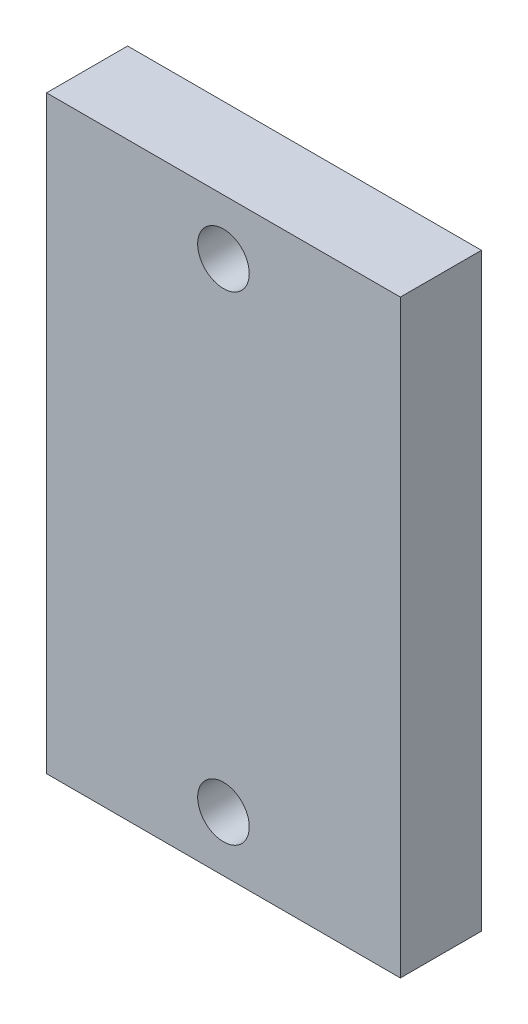
ISO-10303-21;
HEADER;
FILE_DESCRIPTION(('STEP AP214'),'2;1');
FILE_NAME('part.step','',(''),(''),'','','');
FILE_SCHEMA(('AUTOMOTIVE_DESIGN { 1 0 10303 214 1 1 1 1 }'));
ENDSEC;
DATA;
#1=APPLICATION_CONTEXT('core data for automotive mechanical design processes');
#2=APPLICATION_PROTOCOL_DEFINITION('international standard','automotive_design',2000,#1);
#3=PRODUCT_CONTEXT('',#1,'mechanical');
#4=PRODUCT('Part','Part','',(#3));
#5=PRODUCT_RELATED_PRODUCT_CATEGORY('part','',(#4));
#6=PRODUCT_DEFINITION_FORMATION('','',#4);
#7=PRODUCT_DEFINITION_CONTEXT('part definition',#1,'design');
#8=PRODUCT_DEFINITION('design','',#6,#7);
#9=PRODUCT_DEFINITION_SHAPE('','',#8);
#10=(LENGTH_UNIT() NAMED_UNIT(*) SI_UNIT(.MILLI.,.METRE.));
#11=(NAMED_UNIT(*) PLANE_ANGLE_UNIT() SI_UNIT($,.RADIAN.));
#12=(NAMED_UNIT(*) SI_UNIT($,.STERADIAN.) SOLID_ANGLE_UNIT());
#13=UNCERTAINTY_MEASURE_WITH_UNIT(LENGTH_MEASURE(1.E-05),#10,'distance_accuracy_value','');
#14=(GEOMETRIC_REPRESENTATION_CONTEXT(3) GLOBAL_UNCERTAINTY_ASSIGNED_CONTEXT((#13)) GLOBAL_UNIT_ASSIGNED_CONTEXT((#10,
#11,#12)) REPRESENTATION_CONTEXT('',''));
#15=CARTESIAN_POINT('',(0.,0.,0.));
#16=DIRECTION('',(0.,0.,1.));
#17=DIRECTION('',(1.,0.,0.));
#18=AXIS2_PLACEMENT_3D('',#15,#16,#17);
#19=CARTESIAN_POINT('',(0.,0.,5.5));
#20=DIRECTION('',(0.,0.,1.));
#21=DIRECTION('',(1.,0.,0.));
#22=AXIS2_PLACEMENT_3D('',#19,#20,#21);
#23=PLANE('',#22);
#24=CARTESIAN_POINT('',(0.,16.25,5.5));
#25=DIRECTION('',(0.,0.,1.));
#26=DIRECTION('',(1.,0.,0.));
#27=AXIS2_PLACEMENT_3D('',#24,#25,#26);
#28=CIRCLE('',#27,1.75);
#29=CARTESIAN_POINT('',(1.75,16.25,5.5));
#30=VERTEX_POINT('',#29);
#31=EDGE_CURVE('E99',#30,#30,#28,.T.);
#32=ORIENTED_EDGE('',*,*,#31,.F.);
#33=EDGE_LOOP('',(#32));
#34=FACE_BOUND('',#33,.T.);
#35=DIRECTION('',(0.,-1.,0.));
#36=VECTOR('',#35,1.);
#37=CARTESIAN_POINT('',(-12.,-20.,5.5));
#38=LINE('',#37,#36);
#39=CARTESIAN_POINT('',(-12.,20.,5.5));
#40=VERTEX_POINT('',#39);
#41=CARTESIAN_POINT('',(-12.,-20.,5.5));
#42=VERTEX_POINT('',#41);
#43=EDGE_CURVE('E84',#40,#42,#38,.T.);
#44=ORIENTED_EDGE('',*,*,#43,.T.);
#45=DIRECTION('',(1.,0.,0.));
#46=VECTOR('',#45,1.);
#47=CARTESIAN_POINT('',(12.,-20.,5.5));
#48=LINE('',#47,#46);
#49=CARTESIAN_POINT('',(12.,-20.,5.5));
#50=VERTEX_POINT('',#49);
#51=EDGE_CURVE('E79',#42,#50,#48,.T.);
#52=ORIENTED_EDGE('',*,*,#51,.T.);
#53=DIRECTION('',(0.,1.,0.));
#54=VECTOR('',#53,1.);
#55=CARTESIAN_POINT('',(12.,-20.,5.5));
#56=LINE('',#55,#54);
#57=CARTESIAN_POINT('',(12.,20.,5.5));
#58=VERTEX_POINT('',#57);
#59=EDGE_CURVE('E82',#50,#58,#56,.T.);
#60=ORIENTED_EDGE('',*,*,#59,.T.);
#61=DIRECTION('',(-1.,0.,0.));
#62=VECTOR('',#61,1.);
#63=CARTESIAN_POINT('',(12.,20.,5.5));
#64=LINE('',#63,#62);
#65=EDGE_CURVE('E49',#58,#40,#64,.T.);
#66=ORIENTED_EDGE('',*,*,#65,.T.);
#67=EDGE_LOOP('',(#44,#52,#60,#66));
#68=FACE_BOUND('',#67,.T.);
#69=CARTESIAN_POINT('',(0.,-16.25,5.5));
#70=DIRECTION('',(0.,0.,1.));
#71=DIRECTION('',(1.,0.,0.));
#72=AXIS2_PLACEMENT_3D('',#69,#70,#71);
#73=CIRCLE('',#72,1.75);
#74=CARTESIAN_POINT('',(1.75,-16.25,5.5));
#75=VERTEX_POINT('',#74);
#76=EDGE_CURVE('E114',#75,#75,#73,.T.);
#77=ORIENTED_EDGE('',*,*,#76,.F.);
#78=EDGE_LOOP('',(#77));
#79=FACE_BOUND('',#78,.T.);
#80=ADVANCED_FACE('F32',(#34,#68,#79),#23,.T.);
#81=CARTESIAN_POINT('',(0.,0.,0.));
#82=DIRECTION('',(0.,0.,1.));
#83=DIRECTION('',(1.,0.,0.));
#84=AXIS2_PLACEMENT_3D('',#81,#82,#83);
#85=PLANE('',#84);
#86=DIRECTION('',(0.,-1.,0.));
#87=VECTOR('',#86,1.);
#88=CARTESIAN_POINT('',(-12.,-20.,0.));
#89=LINE('',#88,#87);
#90=CARTESIAN_POINT('',(-12.,20.,0.));
#91=VERTEX_POINT('',#90);
#92=CARTESIAN_POINT('',(-12.,-20.,0.));
#93=VERTEX_POINT('',#92);
#94=EDGE_CURVE('E96',#91,#93,#89,.T.);
#95=ORIENTED_EDGE('',*,*,#94,.F.);
#96=DIRECTION('',(-1.,0.,0.));
#97=VECTOR('',#96,1.);
#98=CARTESIAN_POINT('',(12.,20.,0.));
#99=LINE('',#98,#97);
#100=CARTESIAN_POINT('',(12.,20.,0.));
#101=VERTEX_POINT('',#100);
#102=EDGE_CURVE('E72',#101,#91,#99,.T.);
#103=ORIENTED_EDGE('',*,*,#102,.F.);
#104=DIRECTION('',(0.,1.,0.));
#105=VECTOR('',#104,1.);
#106=CARTESIAN_POINT('',(12.,-20.,0.));
#107=LINE('',#106,#105);
#108=CARTESIAN_POINT('',(12.,-20.,0.));
#109=VERTEX_POINT('',#108);
#110=EDGE_CURVE('E66',#109,#101,#107,.T.);
#111=ORIENTED_EDGE('',*,*,#110,.F.);
#112=DIRECTION('',(1.,0.,0.));
#113=VECTOR('',#112,1.);
#114=CARTESIAN_POINT('',(12.,-20.,0.));
#115=LINE('',#114,#113);
#116=EDGE_CURVE('E88',#93,#109,#115,.T.);
#117=ORIENTED_EDGE('',*,*,#116,.F.);
#118=EDGE_LOOP('',(#95,#103,#111,#117));
#119=FACE_BOUND('',#118,.T.);
#120=CARTESIAN_POINT('',(0.,16.25,0.));
#121=DIRECTION('',(0.,0.,1.));
#122=DIRECTION('',(1.,0.,0.));
#123=AXIS2_PLACEMENT_3D('',#120,#121,#122);
#124=CIRCLE('',#123,1.75);
#125=CARTESIAN_POINT('',(1.75,16.25,0.));
#126=VERTEX_POINT('',#125);
#127=EDGE_CURVE('E111',#126,#126,#124,.T.);
#128=ORIENTED_EDGE('',*,*,#127,.T.);
#129=EDGE_LOOP('',(#128));
#130=FACE_BOUND('',#129,.T.);
#131=CARTESIAN_POINT('',(0.,-16.25,0.));
#132=DIRECTION('',(0.,0.,1.));
#133=DIRECTION('',(1.,0.,0.));
#134=AXIS2_PLACEMENT_3D('',#131,#132,#133);
#135=CIRCLE('',#134,1.75);
#136=CARTESIAN_POINT('',(1.75,-16.25,0.));
#137=VERTEX_POINT('',#136);
#138=EDGE_CURVE('E117',#137,#137,#135,.T.);
#139=ORIENTED_EDGE('',*,*,#138,.T.);
#140=EDGE_LOOP('',(#139));
#141=FACE_BOUND('',#140,.T.);
#142=ADVANCED_FACE('F107',(#119,#130,#141),#85,.F.);
#143=CARTESIAN_POINT('',(-12.,-20.,5.5));
#144=DIRECTION('',(1.,0.,0.));
#145=DIRECTION('',(0.,0.,-1.));
#146=AXIS2_PLACEMENT_3D('',#143,#144,#145);
#147=PLANE('',#146);
#148=ORIENTED_EDGE('',*,*,#94,.T.);
#149=DIRECTION('',(0.,0.,-1.));
#150=VECTOR('',#149,1.);
#151=CARTESIAN_POINT('',(-12.,-20.,5.5));
#152=LINE('',#151,#150);
#153=EDGE_CURVE('E11',#42,#93,#152,.T.);
#154=ORIENTED_EDGE('',*,*,#153,.F.);
#155=ORIENTED_EDGE('',*,*,#43,.F.);
#156=DIRECTION('',(0.,0.,-1.));
#157=VECTOR('',#156,1.);
#158=CARTESIAN_POINT('',(-12.,20.,5.5));
#159=LINE('',#158,#157);
#160=EDGE_CURVE('E92',#40,#91,#159,.T.);
#161=ORIENTED_EDGE('',*,*,#160,.T.);
#162=EDGE_LOOP('',(#148,#154,#155,#161));
#163=FACE_BOUND('',#162,.T.);
#164=ADVANCED_FACE('F34',(#163),#147,.F.);
#165=CARTESIAN_POINT('',(12.,-20.,5.5));
#166=DIRECTION('',(0.,1.,0.));
#167=DIRECTION('',(-1.,0.,0.));
#168=AXIS2_PLACEMENT_3D('',#165,#166,#167);
#169=PLANE('',#168);
#170=ORIENTED_EDGE('',*,*,#116,.T.);
#171=DIRECTION('',(0.,0.,-1.));
#172=VECTOR('',#171,1.);
#173=CARTESIAN_POINT('',(12.,-20.,5.5));
#174=LINE('',#173,#172);
#175=EDGE_CURVE('E41',#50,#109,#174,.T.);
#176=ORIENTED_EDGE('',*,*,#175,.F.);
#177=ORIENTED_EDGE('',*,*,#51,.F.);
#178=ORIENTED_EDGE('',*,*,#153,.T.);
#179=EDGE_LOOP('',(#170,#176,#177,#178));
#180=FACE_BOUND('',#179,.T.);
#181=ADVANCED_FACE('F87',(#180),#169,.F.);
#182=CARTESIAN_POINT('',(12.,-20.,5.5));
#183=DIRECTION('',(-1.,0.,0.));
#184=DIRECTION('',(0.,-1.,0.));
#185=AXIS2_PLACEMENT_3D('',#182,#183,#184);
#186=PLANE('',#185);
#187=ORIENTED_EDGE('',*,*,#110,.T.);
#188=DIRECTION('',(0.,0.,-1.));
#189=VECTOR('',#188,1.);
#190=CARTESIAN_POINT('',(12.,20.,5.5));
#191=LINE('',#190,#189);
#192=EDGE_CURVE('E89',#58,#101,#191,.T.);
#193=ORIENTED_EDGE('',*,*,#192,.F.);
#194=ORIENTED_EDGE('',*,*,#59,.F.);
#195=ORIENTED_EDGE('',*,*,#175,.T.);
#196=EDGE_LOOP('',(#187,#193,#194,#195));
#197=FACE_BOUND('',#196,.T.);
#198=ADVANCED_FACE('F90',(#197),#186,.F.);
#199=CARTESIAN_POINT('',(12.,20.,5.5));
#200=DIRECTION('',(0.,-1.,0.));
#201=DIRECTION('',(1.,0.,0.));
#202=AXIS2_PLACEMENT_3D('',#199,#200,#201);
#203=PLANE('',#202);
#204=ORIENTED_EDGE('',*,*,#102,.T.);
#205=ORIENTED_EDGE('',*,*,#160,.F.);
#206=ORIENTED_EDGE('',*,*,#65,.F.);
#207=ORIENTED_EDGE('',*,*,#192,.T.);
#208=EDGE_LOOP('',(#204,#205,#206,#207));
#209=FACE_BOUND('',#208,.T.);
#210=ADVANCED_FACE('F104',(#209),#203,.F.);
#211=CARTESIAN_POINT('',(0.,16.25,5.5));
#212=DIRECTION('',(0.,0.,-1.));
#213=DIRECTION('',(-1.,0.,0.));
#214=AXIS2_PLACEMENT_3D('',#211,#212,#213);
#215=CYLINDRICAL_SURFACE('',#214,1.75);
#216=ORIENTED_EDGE('',*,*,#31,.T.);
#217=EDGE_LOOP('',(#216));
#218=FACE_BOUND('',#217,.T.);
#219=ORIENTED_EDGE('',*,*,#127,.F.);
#220=EDGE_LOOP('',(#219));
#221=FACE_BOUND('',#220,.T.);
#222=ADVANCED_FACE('F134',(#218,#221),#215,.F.);
#223=CARTESIAN_POINT('',(0.,-16.25,5.5));
#224=DIRECTION('',(0.,0.,-1.));
#225=DIRECTION('',(-1.,0.,0.));
#226=AXIS2_PLACEMENT_3D('',#223,#224,#225);
#227=CYLINDRICAL_SURFACE('',#226,1.75);
#228=ORIENTED_EDGE('',*,*,#76,.T.);
#229=EDGE_LOOP('',(#228));
#230=FACE_BOUND('',#229,.T.);
#231=ORIENTED_EDGE('',*,*,#138,.F.);
#232=EDGE_LOOP('',(#231));
#233=FACE_BOUND('',#232,.T.);
#234=ADVANCED_FACE('F123',(#230,#233),#227,.F.);
#235=CLOSED_SHELL('',(#80,#142,#164,#181,#198,#210,#222,#234));
#236=MANIFOLD_SOLID_BREP('B2',#235);
#237=ADVANCED_BREP_SHAPE_REPRESENTATION('',(#18,#236),#14);
#238=SHAPE_DEFINITION_REPRESENTATION(#9,#237);
ENDSEC;
END-ISO-10303-21;
